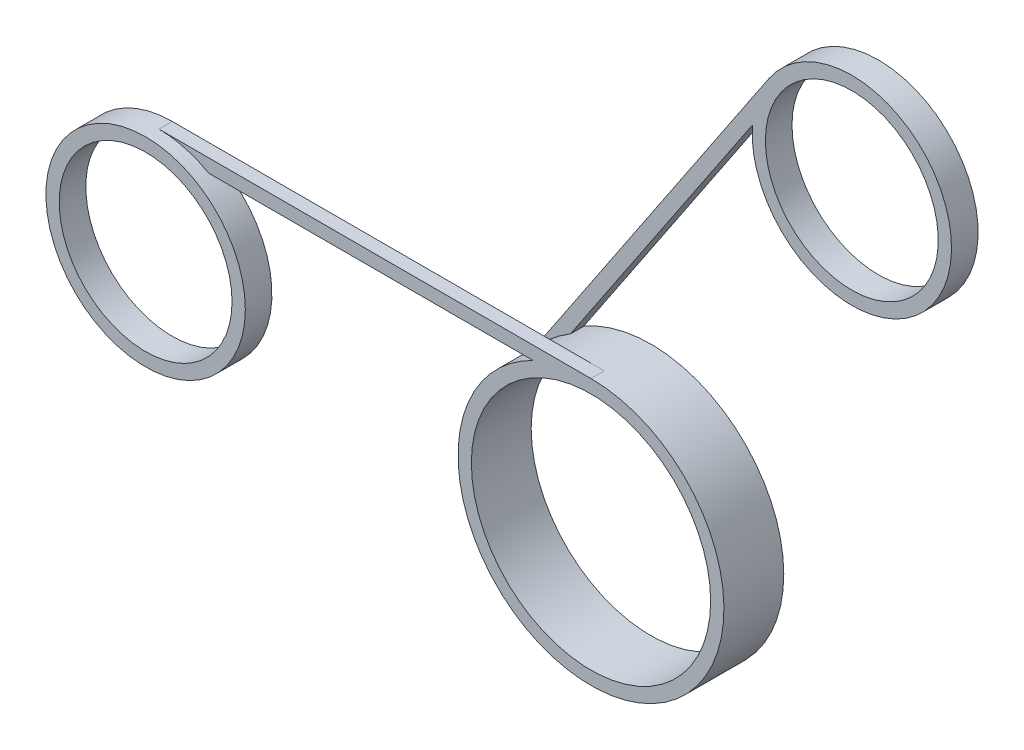
ISO-10303-21;
HEADER;
FILE_DESCRIPTION(('STEP AP214'),'2;1');
FILE_NAME('part.step','',(''),(''),'','','');
FILE_SCHEMA(('AUTOMOTIVE_DESIGN { 1 0 10303 214 1 1 1 1 }'));
ENDSEC;
DATA;
#1=APPLICATION_CONTEXT('core data for automotive mechanical design processes');
#2=APPLICATION_PROTOCOL_DEFINITION('international standard','automotive_design',2000,#1);
#3=PRODUCT_CONTEXT('',#1,'mechanical');
#4=PRODUCT('Part','Part','',(#3));
#5=PRODUCT_RELATED_PRODUCT_CATEGORY('part','',(#4));
#6=PRODUCT_DEFINITION_FORMATION('','',#4);
#7=PRODUCT_DEFINITION_CONTEXT('part definition',#1,'design');
#8=PRODUCT_DEFINITION('design','',#6,#7);
#9=PRODUCT_DEFINITION_SHAPE('','',#8);
#10=(LENGTH_UNIT() NAMED_UNIT(*) SI_UNIT(.MILLI.,.METRE.));
#11=(NAMED_UNIT(*) PLANE_ANGLE_UNIT() SI_UNIT($,.RADIAN.));
#12=(NAMED_UNIT(*) SI_UNIT($,.STERADIAN.) SOLID_ANGLE_UNIT());
#13=UNCERTAINTY_MEASURE_WITH_UNIT(LENGTH_MEASURE(1.E-05),#10,'distance_accuracy_value','');
#14=(GEOMETRIC_REPRESENTATION_CONTEXT(3) GLOBAL_UNCERTAINTY_ASSIGNED_CONTEXT((#13)) GLOBAL_UNIT_ASSIGNED_CONTEXT((#10,
#11,#12)) REPRESENTATION_CONTEXT('',''));
#15=CARTESIAN_POINT('',(0.,0.,0.));
#16=DIRECTION('',(0.,0.,1.));
#17=DIRECTION('',(1.,0.,0.));
#18=AXIS2_PLACEMENT_3D('',#15,#16,#17);
#19=CARTESIAN_POINT('',(10.7164950382095,32.1827826275243,1.));
#20=DIRECTION('',(0.830988464290159,-0.55628964777055,0.));
#21=DIRECTION('',(0.55628964777055,0.830988464290159,0.));
#22=AXIS2_PLACEMENT_3D('',#19,#20,#21);
#23=PLANE('',#22);
#24=DIRECTION('',(-0.55628964777055,-0.830988464290159,0.));
#25=VECTOR('',#24,1.);
#26=CARTESIAN_POINT('',(10.7164950382095,32.1827826275243,0.));
#27=LINE('',#26,#25);
#28=CARTESIAN_POINT('',(8.63502380081733,29.0734697112104,0.));
#29=VERTEX_POINT('',#28);
#30=CARTESIAN_POINT('',(-5.0494654380512,8.63150617157437,0.));
#31=VERTEX_POINT('',#30);
#32=EDGE_CURVE('E119',#29,#31,#27,.T.);
#33=ORIENTED_EDGE('',*,*,#32,.F.);
#34=DIRECTION('',(0.,0.,1.));
#35=VECTOR('',#34,1.);
#36=CARTESIAN_POINT('',(8.63502380081733,29.0734697112104,-1.));
#37=LINE('',#36,#35);
#38=CARTESIAN_POINT('',(8.63502380081733,29.0734697112104,1.));
#39=VERTEX_POINT('',#38);
#40=EDGE_CURVE('E108',#29,#39,#37,.T.);
#41=ORIENTED_EDGE('',*,*,#40,.T.);
#42=DIRECTION('',(-0.55628964777055,-0.830988464290159,0.));
#43=VECTOR('',#42,1.);
#44=CARTESIAN_POINT('',(10.7164950382095,32.1827826275243,1.));
#45=LINE('',#44,#43);
#46=CARTESIAN_POINT('',(-5.04946543805121,8.63150617157437,1.));
#47=VERTEX_POINT('',#46);
#48=EDGE_CURVE('E53',#39,#47,#45,.T.);
#49=ORIENTED_EDGE('',*,*,#48,.T.);
#50=DIRECTION('',(0.,0.,-1.));
#51=VECTOR('',#50,1.);
#52=CARTESIAN_POINT('',(-5.0494654380512,8.63150617157437,4.5));
#53=LINE('',#52,#51);
#54=EDGE_CURVE('E135',#31,#47,#53,.F.);
#55=ORIENTED_EDGE('',*,*,#54,.F.);
#56=EDGE_LOOP('',(#33,#41,#49,#55));
#57=FACE_BOUND('',#56,.T.);
#58=ADVANCED_FACE('F38',(#57),#23,.T.);
#59=CARTESIAN_POINT('',(0.,9.,3.5));
#60=DIRECTION('',(0.,-1.,0.));
#61=DIRECTION('',(0.,0.,-1.));
#62=AXIS2_PLACEMENT_3D('',#59,#60,#61);
#63=PLANE('',#62);
#64=DIRECTION('',(1.,0.,0.));
#65=VECTOR('',#64,1.);
#66=CARTESIAN_POINT('',(0.,9.,4.5));
#67=LINE('',#66,#65);
#68=CARTESIAN_POINT('',(-28.7583426132261,9.,4.5));
#69=VERTEX_POINT('',#68);
#70=CARTESIAN_POINT('',(-4.35889894354067,9.,4.5));
#71=VERTEX_POINT('',#70);
#72=EDGE_CURVE('E159',#69,#71,#67,.T.);
#73=ORIENTED_EDGE('',*,*,#72,.F.);
#74=DIRECTION('',(0.,0.,-1.));
#75=VECTOR('',#74,1.);
#76=CARTESIAN_POINT('',(-28.7583426132261,9.,5.5));
#77=LINE('',#76,#75);
#78=CARTESIAN_POINT('',(-28.7583426132261,9.,3.5));
#79=VERTEX_POINT('',#78);
#80=EDGE_CURVE('E151',#69,#79,#77,.T.);
#81=ORIENTED_EDGE('',*,*,#80,.T.);
#82=DIRECTION('',(1.,0.,0.));
#83=VECTOR('',#82,1.);
#84=CARTESIAN_POINT('',(0.,9.,3.5));
#85=LINE('',#84,#83);
#86=CARTESIAN_POINT('',(-4.35889894354067,9.,3.5));
#87=VERTEX_POINT('',#86);
#88=EDGE_CURVE('E158',#79,#87,#85,.T.);
#89=ORIENTED_EDGE('',*,*,#88,.T.);
#90=DIRECTION('',(0.,0.,-1.));
#91=VECTOR('',#90,1.);
#92=CARTESIAN_POINT('',(-4.35889894354067,9.,4.5));
#93=LINE('',#92,#91);
#94=EDGE_CURVE('E173',#71,#87,#93,.T.);
#95=ORIENTED_EDGE('',*,*,#94,.F.);
#96=EDGE_LOOP('',(#73,#81,#89,#95));
#97=FACE_BOUND('',#96,.T.);
#98=ADVANCED_FACE('F195',(#97),#63,.T.);
#99=CARTESIAN_POINT('',(0.,0.,4.5));
#100=DIRECTION('',(0.,0.,-1.));
#101=DIRECTION('',(-1.,0.,0.));
#102=AXIS2_PLACEMENT_3D('',#99,#100,#101);
#103=CYLINDRICAL_SURFACE('',#102,10.);
#104=CARTESIAN_POINT('',(0.,0.,0.));
#105=DIRECTION('',(0.,0.,1.));
#106=DIRECTION('',(1.,0.,0.));
#107=AXIS2_PLACEMENT_3D('',#104,#105,#106);
#108=CIRCLE('',#107,10.);
#109=CARTESIAN_POINT('',(-8.19409693482487,5.73208299160904,0.));
#110=VERTEX_POINT('',#109);
#111=EDGE_CURVE('E42',#110,#31,#108,.T.);
#112=ORIENTED_EDGE('',*,*,#111,.T.);
#113=ORIENTED_EDGE('',*,*,#54,.T.);
#114=CARTESIAN_POINT('',(0.,0.,1.));
#115=DIRECTION('',(0.,0.,-1.));
#116=DIRECTION('',(-1.,0.,0.));
#117=AXIS2_PLACEMENT_3D('',#114,#115,#116);
#118=CIRCLE('',#117,10.);
#119=CARTESIAN_POINT('',(-8.19409693482483,5.7320829916091,1.));
#120=VERTEX_POINT('',#119);
#121=EDGE_CURVE('E60',#120,#47,#118,.T.);
#122=ORIENTED_EDGE('',*,*,#121,.F.);
#123=DIRECTION('',(0.,0.,-1.));
#124=VECTOR('',#123,1.);
#125=CARTESIAN_POINT('',(-8.19409693482487,5.73208299160904,1.));
#126=LINE('',#125,#124);
#127=EDGE_CURVE('E124',#120,#110,#126,.T.);
#128=ORIENTED_EDGE('',*,*,#127,.T.);
#129=EDGE_LOOP('',(#112,#113,#122,#128));
#130=FACE_BOUND('',#129,.T.);
#131=CARTESIAN_POINT('',(0.,0.,4.5));
#132=DIRECTION('',(0.,0.,1.));
#133=DIRECTION('',(1.,0.,0.));
#134=AXIS2_PLACEMENT_3D('',#131,#132,#133);
#135=CIRCLE('',#134,10.);
#136=CARTESIAN_POINT('',(0.,10.,4.5));
#137=VERTEX_POINT('',#136);
#138=EDGE_CURVE('E11',#71,#137,#135,.T.);
#139=ORIENTED_EDGE('',*,*,#138,.F.);
#140=ORIENTED_EDGE('',*,*,#94,.T.);
#141=CARTESIAN_POINT('',(0.,0.,3.5));
#142=DIRECTION('',(0.,0.,-1.));
#143=DIRECTION('',(-1.,0.,0.));
#144=AXIS2_PLACEMENT_3D('',#141,#142,#143);
#145=CIRCLE('',#144,10.);
#146=CARTESIAN_POINT('',(0.,10.,3.5));
#147=VERTEX_POINT('',#146);
#148=EDGE_CURVE('E168',#87,#147,#145,.T.);
#149=ORIENTED_EDGE('',*,*,#148,.T.);
#150=DIRECTION('',(0.,0.,1.));
#151=VECTOR('',#150,1.);
#152=CARTESIAN_POINT('',(0.,10.,3.5));
#153=LINE('',#152,#151);
#154=EDGE_CURVE('E161',#147,#137,#153,.T.);
#155=ORIENTED_EDGE('',*,*,#154,.T.);
#156=EDGE_LOOP('',(#139,#140,#149,#155));
#157=FACE_BOUND('',#156,.T.);
#158=ADVANCED_FACE('F40',(#130,#157),#103,.T.);
#159=CARTESIAN_POINT('',(0.,0.,4.5));
#160=DIRECTION('',(0.,0.,1.));
#161=DIRECTION('',(1.,0.,0.));
#162=AXIS2_PLACEMENT_3D('',#159,#160,#161);
#163=PLANE('',#162);
#164=DIRECTION('',(-1.,0.,0.));
#165=VECTOR('',#164,1.);
#166=CARTESIAN_POINT('',(0.,10.,4.5));
#167=LINE('',#166,#165);
#168=CARTESIAN_POINT('',(-32.5,10.,4.5));
#169=VERTEX_POINT('',#168);
#170=EDGE_CURVE('E154',#137,#169,#167,.T.);
#171=ORIENTED_EDGE('',*,*,#170,.T.);
#172=CARTESIAN_POINT('',(-32.5,2.5,4.5));
#173=DIRECTION('',(0.,0.,1.));
#174=DIRECTION('',(1.,0.,0.));
#175=AXIS2_PLACEMENT_3D('',#172,#173,#174);
#176=CIRCLE('',#175,7.5);
#177=EDGE_CURVE('E147',#169,#69,#176,.F.);
#178=ORIENTED_EDGE('',*,*,#177,.T.);
#179=ORIENTED_EDGE('',*,*,#72,.T.);
#180=ORIENTED_EDGE('',*,*,#138,.T.);
#181=EDGE_LOOP('',(#171,#178,#179,#180));
#182=FACE_BOUND('',#181,.T.);
#183=CARTESIAN_POINT('',(0.,0.,4.5));
#184=DIRECTION('',(0.,0.,1.));
#185=DIRECTION('',(1.,0.,0.));
#186=AXIS2_PLACEMENT_3D('',#183,#184,#185);
#187=CIRCLE('',#186,9.);
#188=CARTESIAN_POINT('',(9.,0.,4.5));
#189=VERTEX_POINT('',#188);
#190=EDGE_CURVE('E176',#189,#189,#187,.T.);
#191=ORIENTED_EDGE('',*,*,#190,.F.);
#192=EDGE_LOOP('',(#191));
#193=FACE_BOUND('',#192,.T.);
#194=ADVANCED_FACE('F185',(#182,#193),#163,.T.);
#195=CARTESIAN_POINT('',(0.,0.,0.));
#196=DIRECTION('',(0.,0.,1.));
#197=DIRECTION('',(1.,0.,0.));
#198=AXIS2_PLACEMENT_3D('',#195,#196,#197);
#199=PLANE('',#198);
#200=CARTESIAN_POINT('',(16.1178940884926,28.5668611267723,0.));
#201=DIRECTION('',(0.,0.,1.));
#202=DIRECTION('',(1.,0.,0.));
#203=AXIS2_PLACEMENT_3D('',#200,#201,#202);
#204=CIRCLE('',#203,7.5);
#205=CARTESIAN_POINT('',(9.88551056893519,32.7390782430246,0.));
#206=VERTEX_POINT('',#205);
#207=EDGE_CURVE('E121',#29,#206,#204,.F.);
#208=ORIENTED_EDGE('',*,*,#207,.F.);
#209=ORIENTED_EDGE('',*,*,#32,.T.);
#210=ORIENTED_EDGE('',*,*,#111,.F.);
#211=DIRECTION('',(0.556295615500309,0.830984469274325,0.));
#212=VECTOR('',#211,1.);
#213=CARTESIAN_POINT('',(-8.19409693482487,5.73208299160904,0.));
#214=LINE('',#213,#212);
#215=EDGE_CURVE('E120',#110,#206,#214,.T.);
#216=ORIENTED_EDGE('',*,*,#215,.T.);
#217=EDGE_LOOP('',(#208,#209,#210,#216));
#218=FACE_BOUND('',#217,.T.);
#219=CARTESIAN_POINT('',(0.,0.,0.));
#220=DIRECTION('',(0.,0.,1.));
#221=DIRECTION('',(1.,0.,0.));
#222=AXIS2_PLACEMENT_3D('',#219,#220,#221);
#223=CIRCLE('',#222,9.);
#224=CARTESIAN_POINT('',(9.,0.,0.));
#225=VERTEX_POINT('',#224);
#226=EDGE_CURVE('E177',#225,#225,#223,.T.);
#227=ORIENTED_EDGE('',*,*,#226,.T.);
#228=EDGE_LOOP('',(#227));
#229=FACE_BOUND('',#228,.T.);
#230=ADVANCED_FACE('F187',(#218,#229),#199,.F.);
#231=CARTESIAN_POINT('',(0.,0.,0.));
#232=DIRECTION('',(0.,0.,1.));
#233=DIRECTION('',(1.,0.,0.));
#234=AXIS2_PLACEMENT_3D('',#231,#232,#233);
#235=CYLINDRICAL_SURFACE('',#234,9.);
#236=ORIENTED_EDGE('',*,*,#226,.F.);
#237=EDGE_LOOP('',(#236));
#238=FACE_BOUND('',#237,.T.);
#239=ORIENTED_EDGE('',*,*,#190,.T.);
#240=EDGE_LOOP('',(#239));
#241=FACE_BOUND('',#240,.T.);
#242=ADVANCED_FACE('F183',(#238,#241),#235,.F.);
#243=CARTESIAN_POINT('',(0.,0.,3.5));
#244=DIRECTION('',(0.,0.,-1.));
#245=DIRECTION('',(-1.,0.,0.));
#246=AXIS2_PLACEMENT_3D('',#243,#244,#245);
#247=PLANE('',#246);
#248=CARTESIAN_POINT('',(-32.5,2.5,3.5));
#249=DIRECTION('',(0.,0.,1.));
#250=DIRECTION('',(1.,0.,0.));
#251=AXIS2_PLACEMENT_3D('',#248,#249,#250);
#252=CIRCLE('',#251,6.5);
#253=CARTESIAN_POINT('',(-26.,2.5,3.5));
#254=VERTEX_POINT('',#253);
#255=EDGE_CURVE('E138',#254,#254,#252,.T.);
#256=ORIENTED_EDGE('',*,*,#255,.T.);
#257=EDGE_LOOP('',(#256));
#258=FACE_BOUND('',#257,.T.);
#259=ORIENTED_EDGE('',*,*,#88,.F.);
#260=CARTESIAN_POINT('',(-32.5,2.5,3.5));
#261=DIRECTION('',(0.,0.,1.));
#262=DIRECTION('',(1.,0.,0.));
#263=AXIS2_PLACEMENT_3D('',#260,#261,#262);
#264=CIRCLE('',#263,7.5);
#265=CARTESIAN_POINT('',(-32.5,10.,3.5));
#266=VERTEX_POINT('',#265);
#267=EDGE_CURVE('E141',#266,#79,#264,.T.);
#268=ORIENTED_EDGE('',*,*,#267,.F.);
#269=DIRECTION('',(-1.,0.,0.));
#270=VECTOR('',#269,1.);
#271=CARTESIAN_POINT('',(0.,10.,3.5));
#272=LINE('',#271,#270);
#273=EDGE_CURVE('E155',#147,#266,#272,.T.);
#274=ORIENTED_EDGE('',*,*,#273,.F.);
#275=ORIENTED_EDGE('',*,*,#148,.F.);
#276=EDGE_LOOP('',(#259,#268,#274,#275));
#277=FACE_BOUND('',#276,.T.);
#278=ADVANCED_FACE('F224',(#258,#277),#247,.T.);
#279=CARTESIAN_POINT('',(0.,10.,3.5));
#280=DIRECTION('',(0.,1.,0.));
#281=DIRECTION('',(-1.,0.,0.));
#282=AXIS2_PLACEMENT_3D('',#279,#280,#281);
#283=PLANE('',#282);
#284=ORIENTED_EDGE('',*,*,#170,.F.);
#285=ORIENTED_EDGE('',*,*,#154,.F.);
#286=ORIENTED_EDGE('',*,*,#273,.T.);
#287=DIRECTION('',(0.,0.,1.));
#288=VECTOR('',#287,1.);
#289=CARTESIAN_POINT('',(-32.5,10.,3.5));
#290=LINE('',#289,#288);
#291=EDGE_CURVE('E165',#266,#169,#290,.T.);
#292=ORIENTED_EDGE('',*,*,#291,.T.);
#293=EDGE_LOOP('',(#284,#285,#286,#292));
#294=FACE_BOUND('',#293,.T.);
#295=ADVANCED_FACE('F222',(#294),#283,.T.);
#296=CARTESIAN_POINT('',(-32.5,2.5,5.5));
#297=DIRECTION('',(0.,0.,-1.));
#298=DIRECTION('',(-1.,0.,0.));
#299=AXIS2_PLACEMENT_3D('',#296,#297,#298);
#300=CYLINDRICAL_SURFACE('',#299,7.5);
#301=ORIENTED_EDGE('',*,*,#80,.F.);
#302=ORIENTED_EDGE('',*,*,#177,.F.);
#303=ORIENTED_EDGE('',*,*,#291,.F.);
#304=ORIENTED_EDGE('',*,*,#267,.T.);
#305=EDGE_LOOP('',(#301,#302,#303,#304));
#306=FACE_BOUND('',#305,.T.);
#307=CARTESIAN_POINT('',(-32.5,2.5,5.5));
#308=DIRECTION('',(0.,0.,1.));
#309=DIRECTION('',(1.,0.,0.));
#310=AXIS2_PLACEMENT_3D('',#307,#308,#309);
#311=CIRCLE('',#310,7.5);
#312=CARTESIAN_POINT('',(-25.,2.5,5.5));
#313=VERTEX_POINT('',#312);
#314=EDGE_CURVE('E144',#313,#313,#311,.T.);
#315=ORIENTED_EDGE('',*,*,#314,.F.);
#316=EDGE_LOOP('',(#315));
#317=FACE_BOUND('',#316,.T.);
#318=ADVANCED_FACE('F218',(#306,#317),#300,.T.);
#319=CARTESIAN_POINT('',(-32.5,2.5,5.5));
#320=DIRECTION('',(0.,0.,1.));
#321=DIRECTION('',(1.,0.,0.));
#322=AXIS2_PLACEMENT_3D('',#319,#320,#321);
#323=PLANE('',#322);
#324=CARTESIAN_POINT('',(-32.5,2.5,5.5));
#325=DIRECTION('',(0.,0.,1.));
#326=DIRECTION('',(1.,0.,0.));
#327=AXIS2_PLACEMENT_3D('',#324,#325,#326);
#328=CIRCLE('',#327,6.5);
#329=CARTESIAN_POINT('',(-26.,2.5,5.5));
#330=VERTEX_POINT('',#329);
#331=EDGE_CURVE('E137',#330,#330,#328,.T.);
#332=ORIENTED_EDGE('',*,*,#331,.F.);
#333=EDGE_LOOP('',(#332));
#334=FACE_BOUND('',#333,.T.);
#335=ORIENTED_EDGE('',*,*,#314,.T.);
#336=EDGE_LOOP('',(#335));
#337=FACE_BOUND('',#336,.T.);
#338=ADVANCED_FACE('F214',(#334,#337),#323,.T.);
#339=CARTESIAN_POINT('',(-32.5,2.5,3.5));
#340=DIRECTION('',(0.,0.,1.));
#341=DIRECTION('',(1.,0.,0.));
#342=AXIS2_PLACEMENT_3D('',#339,#340,#341);
#343=CYLINDRICAL_SURFACE('',#342,6.5);
#344=ORIENTED_EDGE('',*,*,#255,.F.);
#345=EDGE_LOOP('',(#344));
#346=FACE_BOUND('',#345,.T.);
#347=ORIENTED_EDGE('',*,*,#331,.T.);
#348=EDGE_LOOP('',(#347));
#349=FACE_BOUND('',#348,.T.);
#350=ADVANCED_FACE('F211',(#346,#349),#343,.F.);
#351=CARTESIAN_POINT('',(0.,0.,1.));
#352=DIRECTION('',(0.,0.,-1.));
#353=DIRECTION('',(-1.,0.,0.));
#354=AXIS2_PLACEMENT_3D('',#351,#352,#353);
#355=PLANE('',#354);
#356=CARTESIAN_POINT('',(16.1178940884926,28.5668611267723,1.));
#357=DIRECTION('',(0.,0.,-1.));
#358=DIRECTION('',(-1.,0.,0.));
#359=AXIS2_PLACEMENT_3D('',#356,#357,#358);
#360=CIRCLE('',#359,6.5);
#361=CARTESIAN_POINT('',(9.61789408849261,28.5668611267723,1.));
#362=VERTEX_POINT('',#361);
#363=EDGE_CURVE('E116',#362,#362,#360,.T.);
#364=ORIENTED_EDGE('',*,*,#363,.T.);
#365=EDGE_LOOP('',(#364));
#366=FACE_BOUND('',#365,.T.);
#367=ORIENTED_EDGE('',*,*,#48,.F.);
#368=CARTESIAN_POINT('',(16.1178940884926,28.5668611267723,1.));
#369=DIRECTION('',(0.,0.,-1.));
#370=DIRECTION('',(-1.,0.,0.));
#371=AXIS2_PLACEMENT_3D('',#368,#369,#370);
#372=CIRCLE('',#371,7.5);
#373=CARTESIAN_POINT('',(9.88551056893517,32.7390782430246,1.));
#374=VERTEX_POINT('',#373);
#375=EDGE_CURVE('E105',#374,#39,#372,.T.);
#376=ORIENTED_EDGE('',*,*,#375,.F.);
#377=DIRECTION('',(0.556295615500309,0.830984469274325,0.));
#378=VECTOR('',#377,1.);
#379=CARTESIAN_POINT('',(-8.19409693482487,5.73208299160904,1.));
#380=LINE('',#379,#378);
#381=EDGE_CURVE('E125',#120,#374,#380,.T.);
#382=ORIENTED_EDGE('',*,*,#381,.F.);
#383=ORIENTED_EDGE('',*,*,#121,.T.);
#384=EDGE_LOOP('',(#367,#376,#382,#383));
#385=FACE_BOUND('',#384,.T.);
#386=ADVANCED_FACE('F123',(#366,#385),#355,.F.);
#387=CARTESIAN_POINT('',(-8.19409693482487,5.73208299160904,1.));
#388=DIRECTION('',(-0.830984469274325,0.556295615500309,0.));
#389=DIRECTION('',(-0.556295615500309,-0.830984469274325,0.));
#390=AXIS2_PLACEMENT_3D('',#387,#388,#389);
#391=PLANE('',#390);
#392=ORIENTED_EDGE('',*,*,#215,.F.);
#393=ORIENTED_EDGE('',*,*,#127,.F.);
#394=ORIENTED_EDGE('',*,*,#381,.T.);
#395=DIRECTION('',(0.,0.,-1.));
#396=VECTOR('',#395,1.);
#397=CARTESIAN_POINT('',(9.88551056893519,32.7390782430246,1.));
#398=LINE('',#397,#396);
#399=EDGE_CURVE('E111',#374,#206,#398,.T.);
#400=ORIENTED_EDGE('',*,*,#399,.T.);
#401=EDGE_LOOP('',(#392,#393,#394,#400));
#402=FACE_BOUND('',#401,.T.);
#403=ADVANCED_FACE('F207',(#402),#391,.T.);
#404=CARTESIAN_POINT('',(16.1178940884926,28.5668611267723,-1.));
#405=DIRECTION('',(0.,0.,1.));
#406=DIRECTION('',(1.,0.,0.));
#407=AXIS2_PLACEMENT_3D('',#404,#405,#406);
#408=CYLINDRICAL_SURFACE('',#407,7.5);
#409=ORIENTED_EDGE('',*,*,#40,.F.);
#410=ORIENTED_EDGE('',*,*,#207,.T.);
#411=ORIENTED_EDGE('',*,*,#399,.F.);
#412=ORIENTED_EDGE('',*,*,#375,.T.);
#413=EDGE_LOOP('',(#409,#410,#411,#412));
#414=FACE_BOUND('',#413,.T.);
#415=CARTESIAN_POINT('',(16.1178940884926,28.5668611267723,-1.));
#416=DIRECTION('',(0.,0.,-1.));
#417=DIRECTION('',(-1.,0.,0.));
#418=AXIS2_PLACEMENT_3D('',#415,#416,#417);
#419=CIRCLE('',#418,7.5);
#420=CARTESIAN_POINT('',(8.61789408849261,28.5668611267723,-1.));
#421=VERTEX_POINT('',#420);
#422=EDGE_CURVE('E115',#421,#421,#419,.T.);
#423=ORIENTED_EDGE('',*,*,#422,.F.);
#424=EDGE_LOOP('',(#423));
#425=FACE_BOUND('',#424,.T.);
#426=ADVANCED_FACE('F106',(#414,#425),#408,.T.);
#427=CARTESIAN_POINT('',(16.1178940884926,28.5668611267723,-1.));
#428=DIRECTION('',(0.,0.,-1.));
#429=DIRECTION('',(-1.,0.,0.));
#430=AXIS2_PLACEMENT_3D('',#427,#428,#429);
#431=PLANE('',#430);
#432=CARTESIAN_POINT('',(16.1178940884926,28.5668611267723,-1.));
#433=DIRECTION('',(0.,0.,-1.));
#434=DIRECTION('',(-1.,0.,0.));
#435=AXIS2_PLACEMENT_3D('',#432,#433,#434);
#436=CIRCLE('',#435,6.5);
#437=CARTESIAN_POINT('',(9.61789408849261,28.5668611267723,-1.));
#438=VERTEX_POINT('',#437);
#439=EDGE_CURVE('E354',#438,#438,#436,.T.);
#440=ORIENTED_EDGE('',*,*,#439,.F.);
#441=EDGE_LOOP('',(#440));
#442=FACE_BOUND('',#441,.T.);
#443=ORIENTED_EDGE('',*,*,#422,.T.);
#444=EDGE_LOOP('',(#443));
#445=FACE_BOUND('',#444,.T.);
#446=ADVANCED_FACE('F276',(#442,#445),#431,.T.);
#447=CARTESIAN_POINT('',(16.1178940884926,28.5668611267723,1.));
#448=DIRECTION('',(0.,0.,-1.));
#449=DIRECTION('',(-1.,0.,0.));
#450=AXIS2_PLACEMENT_3D('',#447,#448,#449);
#451=CYLINDRICAL_SURFACE('',#450,6.5);
#452=ORIENTED_EDGE('',*,*,#363,.F.);
#453=EDGE_LOOP('',(#452));
#454=FACE_BOUND('',#453,.T.);
#455=ORIENTED_EDGE('',*,*,#439,.T.);
#456=EDGE_LOOP('',(#455));
#457=FACE_BOUND('',#456,.T.);
#458=ADVANCED_FACE('F281',(#454,#457),#451,.F.);
#459=CLOSED_SHELL('',(#58,#98,#158,#194,#230,#242,#278,#295,#318,#338,#350,#386,#403,#426,#446,#458));
#460=MANIFOLD_SOLID_BREP('B2',#459);
#461=ADVANCED_BREP_SHAPE_REPRESENTATION('',(#18,#460),#14);
#462=SHAPE_DEFINITION_REPRESENTATION(#9,#461);
ENDSEC;
END-ISO-10303-21;
